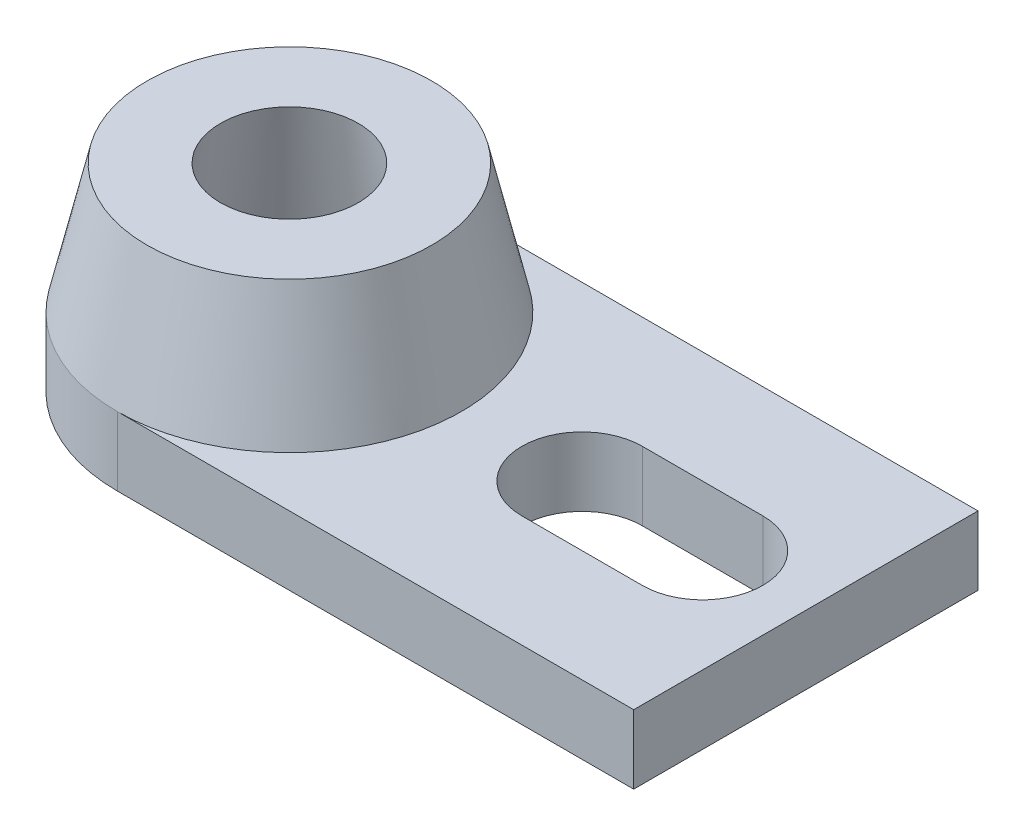
ISO-10303-21;
HEADER;
FILE_DESCRIPTION(('STEP AP214'),'2;1');
FILE_NAME('part.step','',(''),(''),'','','');
FILE_SCHEMA(('AUTOMOTIVE_DESIGN { 1 0 10303 214 1 1 1 1 }'));
ENDSEC;
DATA;
#1=APPLICATION_CONTEXT('core data for automotive mechanical design processes');
#2=APPLICATION_PROTOCOL_DEFINITION('international standard','automotive_design',2000,#1);
#3=PRODUCT_CONTEXT('',#1,'mechanical');
#4=PRODUCT('Part','Part','',(#3));
#5=PRODUCT_RELATED_PRODUCT_CATEGORY('part','',(#4));
#6=PRODUCT_DEFINITION_FORMATION('','',#4);
#7=PRODUCT_DEFINITION_CONTEXT('part definition',#1,'design');
#8=PRODUCT_DEFINITION('design','',#6,#7);
#9=PRODUCT_DEFINITION_SHAPE('','',#8);
#10=(LENGTH_UNIT() NAMED_UNIT(*) SI_UNIT(.MILLI.,.METRE.));
#11=(NAMED_UNIT(*) PLANE_ANGLE_UNIT() SI_UNIT($,.RADIAN.));
#12=(NAMED_UNIT(*) SI_UNIT($,.STERADIAN.) SOLID_ANGLE_UNIT());
#13=UNCERTAINTY_MEASURE_WITH_UNIT(LENGTH_MEASURE(1.E-05),#10,'distance_accuracy_value','');
#14=(GEOMETRIC_REPRESENTATION_CONTEXT(3) GLOBAL_UNCERTAINTY_ASSIGNED_CONTEXT((#13)) GLOBAL_UNIT_ASSIGNED_CONTEXT((#10,
#11,#12)) REPRESENTATION_CONTEXT('',''));
#15=CARTESIAN_POINT('',(0.,0.,0.));
#16=DIRECTION('',(0.,0.,1.));
#17=DIRECTION('',(1.,0.,0.));
#18=AXIS2_PLACEMENT_3D('',#15,#16,#17);
#19=CARTESIAN_POINT('',(20.,8.,20.));
#20=DIRECTION('',(0.,1.,0.));
#21=DIRECTION('',(0.,0.,1.));
#22=AXIS2_PLACEMENT_3D('',#19,#20,#21);
#23=PLANE('',#22);
#24=CARTESIAN_POINT('',(20.,8.,20.));
#25=DIRECTION('',(0.,1.,0.));
#26=DIRECTION('',(0.,0.,1.));
#27=AXIS2_PLACEMENT_3D('',#24,#25,#26);
#28=CIRCLE('',#27,20.);
#29=CARTESIAN_POINT('',(20.,8.,40.));
#30=VERTEX_POINT('',#29);
#31=CARTESIAN_POINT('',(20.,8.,0.));
#32=VERTEX_POINT('',#31);
#33=EDGE_CURVE('E125',#30,#32,#28,.T.);
#34=ORIENTED_EDGE('',*,*,#33,.F.);
#35=DIRECTION('',(1.,0.,0.));
#36=VECTOR('',#35,1.);
#37=CARTESIAN_POINT('',(20.,8.,40.));
#38=LINE('',#37,#36);
#39=CARTESIAN_POINT('',(80.0000000000001,8.,40.));
#40=VERTEX_POINT('',#39);
#41=EDGE_CURVE('E116',#30,#40,#38,.T.);
#42=ORIENTED_EDGE('',*,*,#41,.T.);
#43=DIRECTION('',(0.,0.,-1.));
#44=VECTOR('',#43,1.);
#45=CARTESIAN_POINT('',(80.0000000000001,8.,0.));
#46=LINE('',#45,#44);
#47=CARTESIAN_POINT('',(80.0000000000001,8.,0.));
#48=VERTEX_POINT('',#47);
#49=EDGE_CURVE('E123',#40,#48,#46,.T.);
#50=ORIENTED_EDGE('',*,*,#49,.T.);
#51=DIRECTION('',(-1.,0.,0.));
#52=VECTOR('',#51,1.);
#53=CARTESIAN_POINT('',(20.,8.,0.));
#54=LINE('',#53,#52);
#55=EDGE_CURVE('E128',#48,#32,#54,.T.);
#56=ORIENTED_EDGE('',*,*,#55,.T.);
#57=EDGE_LOOP('',(#34,#42,#50,#56));
#58=FACE_BOUND('',#57,.T.);
#59=DIRECTION('',(-1.,0.,0.));
#60=VECTOR('',#59,1.);
#61=CARTESIAN_POINT('',(68.0000000000001,8.,13.));
#62=LINE('',#61,#60);
#63=CARTESIAN_POINT('',(68.0000000000001,8.,13.));
#64=VERTEX_POINT('',#63);
#65=CARTESIAN_POINT('',(54.0000000000001,8.,13.));
#66=VERTEX_POINT('',#65);
#67=EDGE_CURVE('E231',#64,#66,#62,.T.);
#68=ORIENTED_EDGE('',*,*,#67,.F.);
#69=CARTESIAN_POINT('',(68.0000000000001,8.,20.));
#70=DIRECTION('',(0.,1.,0.));
#71=DIRECTION('',(0.,0.,1.));
#72=AXIS2_PLACEMENT_3D('',#69,#70,#71);
#73=CIRCLE('',#72,7.);
#74=CARTESIAN_POINT('',(68.0000000000001,8.,27.));
#75=VERTEX_POINT('',#74);
#76=EDGE_CURVE('E228',#75,#64,#73,.T.);
#77=ORIENTED_EDGE('',*,*,#76,.F.);
#78=DIRECTION('',(1.,0.,0.));
#79=VECTOR('',#78,1.);
#80=CARTESIAN_POINT('',(54.0000000000001,8.,27.));
#81=LINE('',#80,#79);
#82=CARTESIAN_POINT('',(54.0000000000001,8.,27.));
#83=VERTEX_POINT('',#82);
#84=EDGE_CURVE('E238',#83,#75,#81,.T.);
#85=ORIENTED_EDGE('',*,*,#84,.F.);
#86=CARTESIAN_POINT('',(54.0000000000001,8.,20.));
#87=DIRECTION('',(0.,1.,0.));
#88=DIRECTION('',(0.,0.,1.));
#89=AXIS2_PLACEMENT_3D('',#86,#87,#88);
#90=CIRCLE('',#89,7.);
#91=EDGE_CURVE('E235',#66,#83,#90,.T.);
#92=ORIENTED_EDGE('',*,*,#91,.F.);
#93=EDGE_LOOP('',(#68,#77,#85,#92));
#94=FACE_BOUND('',#93,.T.);
#95=ADVANCED_FACE('F39',(#58,#94),#23,.T.);
#96=CARTESIAN_POINT('',(20.,0.,20.));
#97=DIRECTION('',(0.,1.,0.));
#98=DIRECTION('',(0.,0.,1.));
#99=AXIS2_PLACEMENT_3D('',#96,#97,#98);
#100=PLANE('',#99);
#101=CARTESIAN_POINT('',(20.,0.,20.));
#102=DIRECTION('',(0.,1.,0.));
#103=DIRECTION('',(0.,0.,1.));
#104=AXIS2_PLACEMENT_3D('',#101,#102,#103);
#105=CIRCLE('',#104,12.0555205562947);
#106=CARTESIAN_POINT('',(20.,0.,32.0555205562947));
#107=VERTEX_POINT('',#106);
#108=EDGE_CURVE('E133',#107,#107,#105,.T.);
#109=ORIENTED_EDGE('',*,*,#108,.T.);
#110=EDGE_LOOP('',(#109));
#111=FACE_BOUND('',#110,.T.);
#112=CARTESIAN_POINT('',(20.,0.,20.));
#113=DIRECTION('',(0.,1.,0.));
#114=DIRECTION('',(0.,0.,1.));
#115=AXIS2_PLACEMENT_3D('',#112,#113,#114);
#116=CIRCLE('',#115,20.);
#117=CARTESIAN_POINT('',(20.,0.,0.));
#118=VERTEX_POINT('',#117);
#119=CARTESIAN_POINT('',(20.,0.,40.));
#120=VERTEX_POINT('',#119);
#121=EDGE_CURVE('E113',#118,#120,#116,.T.);
#122=ORIENTED_EDGE('',*,*,#121,.F.);
#123=DIRECTION('',(-1.,0.,0.));
#124=VECTOR('',#123,1.);
#125=CARTESIAN_POINT('',(20.,0.,0.));
#126=LINE('',#125,#124);
#127=CARTESIAN_POINT('',(80.0000000000001,0.,0.));
#128=VERTEX_POINT('',#127);
#129=EDGE_CURVE('E137',#128,#118,#126,.T.);
#130=ORIENTED_EDGE('',*,*,#129,.F.);
#131=DIRECTION('',(0.,0.,-1.));
#132=VECTOR('',#131,1.);
#133=CARTESIAN_POINT('',(80.0000000000001,0.,0.));
#134=LINE('',#133,#132);
#135=CARTESIAN_POINT('',(80.0000000000001,0.,40.));
#136=VERTEX_POINT('',#135);
#137=EDGE_CURVE('E140',#136,#128,#134,.T.);
#138=ORIENTED_EDGE('',*,*,#137,.F.);
#139=DIRECTION('',(1.,0.,0.));
#140=VECTOR('',#139,1.);
#141=CARTESIAN_POINT('',(20.,0.,40.));
#142=LINE('',#141,#140);
#143=EDGE_CURVE('E153',#120,#136,#142,.T.);
#144=ORIENTED_EDGE('',*,*,#143,.F.);
#145=EDGE_LOOP('',(#122,#130,#138,#144));
#146=FACE_BOUND('',#145,.T.);
#147=CARTESIAN_POINT('',(68.0000000000001,0.,20.));
#148=DIRECTION('',(0.,1.,0.));
#149=DIRECTION('',(0.,0.,1.));
#150=AXIS2_PLACEMENT_3D('',#147,#148,#149);
#151=CIRCLE('',#150,7.);
#152=CARTESIAN_POINT('',(68.0000000000001,0.,27.));
#153=VERTEX_POINT('',#152);
#154=CARTESIAN_POINT('',(68.0000000000001,0.,13.));
#155=VERTEX_POINT('',#154);
#156=EDGE_CURVE('E63',#153,#155,#151,.T.);
#157=ORIENTED_EDGE('',*,*,#156,.T.);
#158=DIRECTION('',(-1.,0.,0.));
#159=VECTOR('',#158,1.);
#160=CARTESIAN_POINT('',(68.0000000000001,0.,13.));
#161=LINE('',#160,#159);
#162=CARTESIAN_POINT('',(54.0000000000001,0.,13.));
#163=VERTEX_POINT('',#162);
#164=EDGE_CURVE('E244',#155,#163,#161,.T.);
#165=ORIENTED_EDGE('',*,*,#164,.T.);
#166=CARTESIAN_POINT('',(54.0000000000001,0.,20.));
#167=DIRECTION('',(0.,1.,0.));
#168=DIRECTION('',(0.,0.,1.));
#169=AXIS2_PLACEMENT_3D('',#166,#167,#168);
#170=CIRCLE('',#169,7.);
#171=CARTESIAN_POINT('',(54.0000000000001,0.,27.));
#172=VERTEX_POINT('',#171);
#173=EDGE_CURVE('E248',#163,#172,#170,.T.);
#174=ORIENTED_EDGE('',*,*,#173,.T.);
#175=DIRECTION('',(1.,0.,0.));
#176=VECTOR('',#175,1.);
#177=CARTESIAN_POINT('',(54.0000000000001,0.,27.));
#178=LINE('',#177,#176);
#179=EDGE_CURVE('E232',#172,#153,#178,.T.);
#180=ORIENTED_EDGE('',*,*,#179,.T.);
#181=EDGE_LOOP('',(#157,#165,#174,#180));
#182=FACE_BOUND('',#181,.T.);
#183=ADVANCED_FACE('F170',(#111,#146,#182),#100,.F.);
#184=CARTESIAN_POINT('',(20.,8.,20.));
#185=DIRECTION('',(0.,-1.,0.));
#186=DIRECTION('',(0.,0.,-1.));
#187=AXIS2_PLACEMENT_3D('',#184,#185,#186);
#188=CYLINDRICAL_SURFACE('',#187,20.);
#189=ORIENTED_EDGE('',*,*,#121,.T.);
#190=DIRECTION('',(0.,-1.,0.));
#191=VECTOR('',#190,1.);
#192=CARTESIAN_POINT('',(20.,8.,40.));
#193=LINE('',#192,#191);
#194=EDGE_CURVE('E11',#30,#120,#193,.T.);
#195=ORIENTED_EDGE('',*,*,#194,.F.);
#196=CARTESIAN_POINT('',(20.,8.,20.));
#197=DIRECTION('',(0.,1.,0.));
#198=DIRECTION('',(0.,0.,1.));
#199=AXIS2_PLACEMENT_3D('',#196,#197,#198);
#200=CIRCLE('',#199,20.);
#201=EDGE_CURVE('E110',#32,#30,#200,.T.);
#202=ORIENTED_EDGE('',*,*,#201,.F.);
#203=DIRECTION('',(0.,-1.,0.));
#204=VECTOR('',#203,1.);
#205=CARTESIAN_POINT('',(20.,8.,0.));
#206=LINE('',#205,#204);
#207=EDGE_CURVE('E150',#32,#118,#206,.T.);
#208=ORIENTED_EDGE('',*,*,#207,.T.);
#209=EDGE_LOOP('',(#189,#195,#202,#208));
#210=FACE_BOUND('',#209,.T.);
#211=ADVANCED_FACE('F41',(#210),#188,.T.);
#212=CARTESIAN_POINT('',(20.,8.,40.));
#213=DIRECTION('',(0.,0.,-1.));
#214=DIRECTION('',(-1.,0.,0.));
#215=AXIS2_PLACEMENT_3D('',#212,#213,#214);
#216=PLANE('',#215);
#217=ORIENTED_EDGE('',*,*,#143,.T.);
#218=DIRECTION('',(0.,-1.,0.));
#219=VECTOR('',#218,1.);
#220=CARTESIAN_POINT('',(80.0000000000001,8.,40.));
#221=LINE('',#220,#219);
#222=EDGE_CURVE('E48',#40,#136,#221,.T.);
#223=ORIENTED_EDGE('',*,*,#222,.F.);
#224=ORIENTED_EDGE('',*,*,#41,.F.);
#225=ORIENTED_EDGE('',*,*,#194,.T.);
#226=EDGE_LOOP('',(#217,#223,#224,#225));
#227=FACE_BOUND('',#226,.T.);
#228=ADVANCED_FACE('F118',(#227),#216,.F.);
#229=CARTESIAN_POINT('',(80.0000000000001,8.,0.));
#230=DIRECTION('',(-1.,0.,0.));
#231=DIRECTION('',(0.,0.,1.));
#232=AXIS2_PLACEMENT_3D('',#229,#230,#231);
#233=PLANE('',#232);
#234=ORIENTED_EDGE('',*,*,#137,.T.);
#235=DIRECTION('',(0.,-1.,0.));
#236=VECTOR('',#235,1.);
#237=CARTESIAN_POINT('',(80.0000000000001,8.,0.));
#238=LINE('',#237,#236);
#239=EDGE_CURVE('E160',#48,#128,#238,.T.);
#240=ORIENTED_EDGE('',*,*,#239,.F.);
#241=ORIENTED_EDGE('',*,*,#49,.F.);
#242=ORIENTED_EDGE('',*,*,#222,.T.);
#243=EDGE_LOOP('',(#234,#240,#241,#242));
#244=FACE_BOUND('',#243,.T.);
#245=ADVANCED_FACE('F166',(#244),#233,.F.);
#246=CARTESIAN_POINT('',(20.,8.,0.));
#247=DIRECTION('',(0.,0.,1.));
#248=DIRECTION('',(1.,0.,0.));
#249=AXIS2_PLACEMENT_3D('',#246,#247,#248);
#250=PLANE('',#249);
#251=ORIENTED_EDGE('',*,*,#129,.T.);
#252=ORIENTED_EDGE('',*,*,#207,.F.);
#253=ORIENTED_EDGE('',*,*,#55,.F.);
#254=ORIENTED_EDGE('',*,*,#239,.T.);
#255=EDGE_LOOP('',(#251,#252,#253,#254));
#256=FACE_BOUND('',#255,.T.);
#257=ADVANCED_FACE('F173',(#256),#250,.F.);
#258=CARTESIAN_POINT('',(68.0000000000001,8.,20.));
#259=DIRECTION('',(0.,-1.,0.));
#260=DIRECTION('',(0.,0.,-1.));
#261=AXIS2_PLACEMENT_3D('',#258,#259,#260);
#262=CYLINDRICAL_SURFACE('',#261,7.);
#263=ORIENTED_EDGE('',*,*,#156,.F.);
#264=DIRECTION('',(0.,-1.,0.));
#265=VECTOR('',#264,1.);
#266=CARTESIAN_POINT('',(68.0000000000001,8.,27.));
#267=LINE('',#266,#265);
#268=EDGE_CURVE('E241',#75,#153,#267,.T.);
#269=ORIENTED_EDGE('',*,*,#268,.F.);
#270=ORIENTED_EDGE('',*,*,#76,.T.);
#271=DIRECTION('',(0.,-1.,0.));
#272=VECTOR('',#271,1.);
#273=CARTESIAN_POINT('',(68.0000000000001,8.,13.));
#274=LINE('',#273,#272);
#275=EDGE_CURVE('E143',#64,#155,#274,.T.);
#276=ORIENTED_EDGE('',*,*,#275,.T.);
#277=EDGE_LOOP('',(#263,#269,#270,#276));
#278=FACE_BOUND('',#277,.T.);
#279=ADVANCED_FACE('F175',(#278),#262,.F.);
#280=CARTESIAN_POINT('',(68.0000000000001,8.,13.));
#281=DIRECTION('',(0.,0.,1.));
#282=DIRECTION('',(1.,0.,0.));
#283=AXIS2_PLACEMENT_3D('',#280,#281,#282);
#284=PLANE('',#283);
#285=ORIENTED_EDGE('',*,*,#164,.F.);
#286=ORIENTED_EDGE('',*,*,#275,.F.);
#287=ORIENTED_EDGE('',*,*,#67,.T.);
#288=DIRECTION('',(0.,-1.,0.));
#289=VECTOR('',#288,1.);
#290=CARTESIAN_POINT('',(54.0000000000001,8.,13.));
#291=LINE('',#290,#289);
#292=EDGE_CURVE('E258',#66,#163,#291,.T.);
#293=ORIENTED_EDGE('',*,*,#292,.T.);
#294=EDGE_LOOP('',(#285,#286,#287,#293));
#295=FACE_BOUND('',#294,.T.);
#296=ADVANCED_FACE('F181',(#295),#284,.T.);
#297=CARTESIAN_POINT('',(54.0000000000001,8.,20.));
#298=DIRECTION('',(0.,-1.,0.));
#299=DIRECTION('',(0.,0.,-1.));
#300=AXIS2_PLACEMENT_3D('',#297,#298,#299);
#301=CYLINDRICAL_SURFACE('',#300,7.);
#302=ORIENTED_EDGE('',*,*,#173,.F.);
#303=ORIENTED_EDGE('',*,*,#292,.F.);
#304=ORIENTED_EDGE('',*,*,#91,.T.);
#305=DIRECTION('',(0.,-1.,0.));
#306=VECTOR('',#305,1.);
#307=CARTESIAN_POINT('',(54.0000000000001,8.,27.));
#308=LINE('',#307,#306);
#309=EDGE_CURVE('E55',#83,#172,#308,.T.);
#310=ORIENTED_EDGE('',*,*,#309,.T.);
#311=EDGE_LOOP('',(#302,#303,#304,#310));
#312=FACE_BOUND('',#311,.T.);
#313=ADVANCED_FACE('F194',(#312),#301,.F.);
#314=CARTESIAN_POINT('',(54.0000000000001,8.,27.));
#315=DIRECTION('',(0.,0.,-1.));
#316=DIRECTION('',(-1.,0.,0.));
#317=AXIS2_PLACEMENT_3D('',#314,#315,#316);
#318=PLANE('',#317);
#319=ORIENTED_EDGE('',*,*,#179,.F.);
#320=ORIENTED_EDGE('',*,*,#309,.F.);
#321=ORIENTED_EDGE('',*,*,#84,.T.);
#322=ORIENTED_EDGE('',*,*,#268,.T.);
#323=EDGE_LOOP('',(#319,#320,#321,#322));
#324=FACE_BOUND('',#323,.T.);
#325=ADVANCED_FACE('F198',(#324),#318,.T.);
#326=CARTESIAN_POINT('',(20.,8.,20.));
#327=DIRECTION('',(0.,-1.,0.));
#328=DIRECTION('',(0.,0.,1.));
#329=AXIS2_PLACEMENT_3D('',#326,#327,#328);
#330=CONICAL_SURFACE('',#329,20.,0.226892802759263);
#331=CARTESIAN_POINT('',(20.,23.,20.));
#332=DIRECTION('',(0.,1.,0.));
#333=DIRECTION('',(0.,0.,1.));
#334=AXIS2_PLACEMENT_3D('',#331,#332,#333);
#335=CIRCLE('',#334,16.5369771331165);
#336=CARTESIAN_POINT('',(20.,23.,36.5369771331165));
#337=VERTEX_POINT('',#336);
#338=EDGE_CURVE('E132',#337,#337,#335,.T.);
#339=ORIENTED_EDGE('',*,*,#338,.F.);
#340=EDGE_LOOP('',(#339));
#341=FACE_BOUND('',#340,.T.);
#342=ORIENTED_EDGE('',*,*,#33,.T.);
#343=ORIENTED_EDGE('',*,*,#201,.T.);
#344=EDGE_LOOP('',(#342,#343));
#345=FACE_BOUND('',#344,.T.);
#346=ADVANCED_FACE('F135',(#341,#345),#330,.T.);
#347=CARTESIAN_POINT('',(20.,23.,20.));
#348=DIRECTION('',(0.,1.,0.));
#349=DIRECTION('',(0.,0.,1.));
#350=AXIS2_PLACEMENT_3D('',#347,#348,#349);
#351=PLANE('',#350);
#352=CARTESIAN_POINT('',(20.,23.,20.));
#353=DIRECTION('',(0.,1.,0.));
#354=DIRECTION('',(0.,0.,1.));
#355=AXIS2_PLACEMENT_3D('',#352,#353,#354);
#356=CIRCLE('',#355,8.);
#357=CARTESIAN_POINT('',(20.,23.,28.));
#358=VERTEX_POINT('',#357);
#359=EDGE_CURVE('E219',#358,#358,#356,.T.);
#360=ORIENTED_EDGE('',*,*,#359,.F.);
#361=EDGE_LOOP('',(#360));
#362=FACE_BOUND('',#361,.T.);
#363=ORIENTED_EDGE('',*,*,#338,.T.);
#364=EDGE_LOOP('',(#363));
#365=FACE_BOUND('',#364,.T.);
#366=ADVANCED_FACE('F204',(#362,#365),#351,.T.);
#367=CARTESIAN_POINT('',(20.,23.,20.));
#368=DIRECTION('',(0.,-1.,0.));
#369=DIRECTION('',(0.,0.,1.));
#370=AXIS2_PLACEMENT_3D('',#367,#368,#369);
#371=CONICAL_SURFACE('',#370,8.,0.174532925199433);
#372=ORIENTED_EDGE('',*,*,#108,.F.);
#373=EDGE_LOOP('',(#372));
#374=FACE_BOUND('',#373,.T.);
#375=ORIENTED_EDGE('',*,*,#359,.T.);
#376=EDGE_LOOP('',(#375));
#377=FACE_BOUND('',#376,.T.);
#378=ADVANCED_FACE('F208',(#374,#377),#371,.F.);
#379=CLOSED_SHELL('',(#95,#183,#211,#228,#245,#257,#279,#296,#313,#325,#346,#366,#378));
#380=MANIFOLD_SOLID_BREP('B2',#379);
#381=ADVANCED_BREP_SHAPE_REPRESENTATION('',(#18,#380),#14);
#382=SHAPE_DEFINITION_REPRESENTATION(#9,#381);
ENDSEC;
END-ISO-10303-21;
